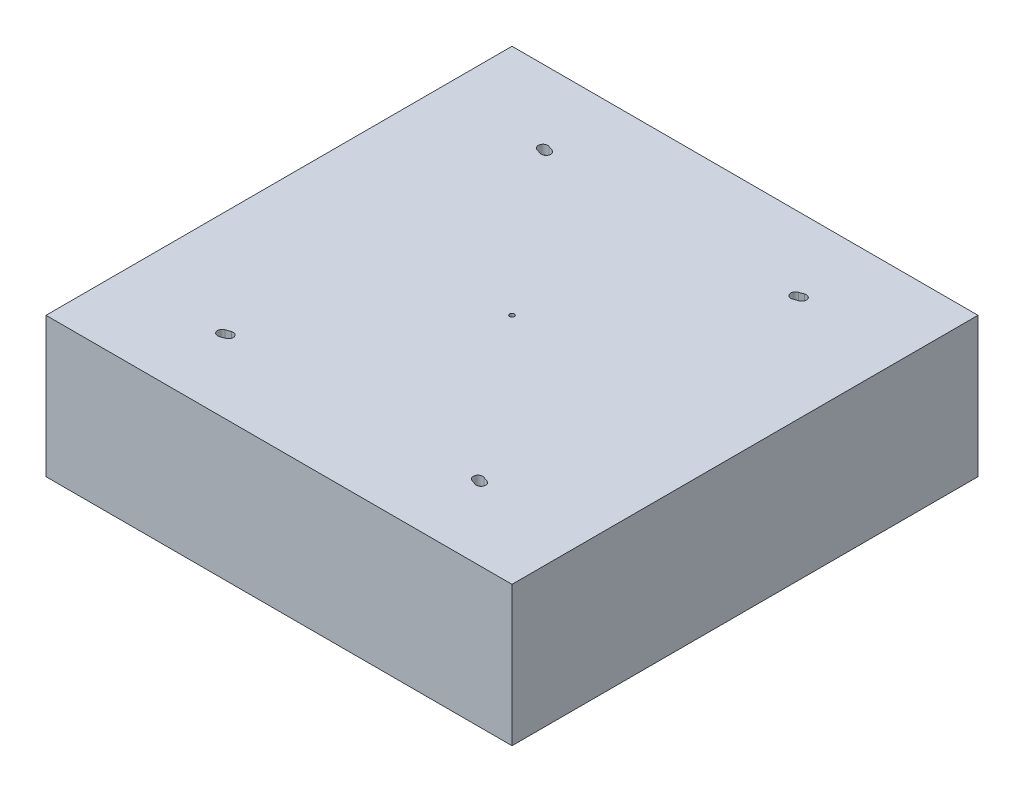
ISO-10303-21;
HEADER;
FILE_DESCRIPTION(('STEP AP214'),'2;1');
FILE_NAME('part.step','',(''),(''),'','','');
FILE_SCHEMA(('AUTOMOTIVE_DESIGN { 1 0 10303 214 1 1 1 1 }'));
ENDSEC;
DATA;
#1=APPLICATION_CONTEXT('core data for automotive mechanical design processes');
#2=APPLICATION_PROTOCOL_DEFINITION('international standard','automotive_design',2000,#1);
#3=PRODUCT_CONTEXT('',#1,'mechanical');
#4=PRODUCT('Part','Part','',(#3));
#5=PRODUCT_RELATED_PRODUCT_CATEGORY('part','',(#4));
#6=PRODUCT_DEFINITION_FORMATION('','',#4);
#7=PRODUCT_DEFINITION_CONTEXT('part definition',#1,'design');
#8=PRODUCT_DEFINITION('design','',#6,#7);
#9=PRODUCT_DEFINITION_SHAPE('','',#8);
#10=(LENGTH_UNIT() NAMED_UNIT(*) SI_UNIT(.MILLI.,.METRE.));
#11=(NAMED_UNIT(*) PLANE_ANGLE_UNIT() SI_UNIT($,.RADIAN.));
#12=(NAMED_UNIT(*) SI_UNIT($,.STERADIAN.) SOLID_ANGLE_UNIT());
#13=UNCERTAINTY_MEASURE_WITH_UNIT(LENGTH_MEASURE(1.E-05),#10,'distance_accuracy_value','');
#14=(GEOMETRIC_REPRESENTATION_CONTEXT(3) GLOBAL_UNCERTAINTY_ASSIGNED_CONTEXT((#13)) GLOBAL_UNIT_ASSIGNED_CONTEXT((#10,
#11,#12)) REPRESENTATION_CONTEXT('',''));
#15=CARTESIAN_POINT('',(0.,0.,0.));
#16=DIRECTION('',(0.,0.,1.));
#17=DIRECTION('',(1.,0.,0.));
#18=AXIS2_PLACEMENT_3D('',#15,#16,#17);
#19=CARTESIAN_POINT('',(0.,15.,0.));
#20=DIRECTION('',(0.,1.,0.));
#21=DIRECTION('',(0.,0.,1.));
#22=AXIS2_PLACEMENT_3D('',#19,#20,#21);
#23=PLANE('',#22);
#24=CARTESIAN_POINT('',(27.7652570431918,15.,-34.4106898083398));
#25=DIRECTION('',(0.,1.,0.));
#26=DIRECTION('',(0.,0.,-1.));
#27=AXIS2_PLACEMENT_3D('',#24,#25,#26);
#28=CIRCLE('',#27,0.999999999999998);
#29=CARTESIAN_POINT('',(28.0908251976489,15.,-33.4651712327405));
#30=VERTEX_POINT('',#29);
#31=CARTESIAN_POINT('',(27.4396888887346,15.,-35.3562083839392));
#32=VERTEX_POINT('',#31);
#33=EDGE_CURVE('E61',#30,#32,#28,.T.);
#34=ORIENTED_EDGE('',*,*,#33,.F.);
#35=DIRECTION('',(0.945518575599316,0.,-0.325568154457158));
#36=VECTOR('',#35,1.);
#37=CARTESIAN_POINT('',(28.0908251976489,15.,-33.4651712327405));
#38=LINE('',#37,#36);
#39=CARTESIAN_POINT('',(27.0908251976489,15.,-33.1208436194509));
#40=VERTEX_POINT('',#39);
#41=EDGE_CURVE('E208',#40,#30,#38,.T.);
#42=ORIENTED_EDGE('',*,*,#41,.F.);
#43=CARTESIAN_POINT('',(26.7652570431918,15.,-34.0663621950502));
#44=DIRECTION('',(0.,1.,0.));
#45=DIRECTION('',(0.,0.,-1.));
#46=AXIS2_PLACEMENT_3D('',#43,#44,#45);
#47=CIRCLE('',#46,0.999999999999998);
#48=CARTESIAN_POINT('',(26.4396888887346,15.,-35.0118807706495));
#49=VERTEX_POINT('',#48);
#50=EDGE_CURVE('E212',#49,#40,#47,.T.);
#51=ORIENTED_EDGE('',*,*,#50,.F.);
#52=DIRECTION('',(-0.945518575599316,0.,0.325568154457158));
#53=VECTOR('',#52,1.);
#54=CARTESIAN_POINT('',(27.4396888887346,15.,-35.3562083839392));
#55=LINE('',#54,#53);
#56=EDGE_CURVE('E221',#32,#49,#55,.T.);
#57=ORIENTED_EDGE('',*,*,#56,.F.);
#58=EDGE_LOOP('',(#34,#42,#51,#57));
#59=FACE_BOUND('',#58,.T.);
#60=CARTESIAN_POINT('',(0.,15.,0.));
#61=DIRECTION('',(0.,1.,0.));
#62=DIRECTION('',(0.,0.,1.));
#63=AXIS2_PLACEMENT_3D('',#60,#61,#62);
#64=CIRCLE('',#63,0.5);
#65=CARTESIAN_POINT('',(0.,15.,0.5));
#66=VERTEX_POINT('',#65);
#67=EDGE_CURVE('E323',#66,#66,#64,.T.);
#68=ORIENTED_EDGE('',*,*,#67,.F.);
#69=EDGE_LOOP('',(#68));
#70=FACE_BOUND('',#69,.T.);
#71=CARTESIAN_POINT('',(-27.7652570431918,15.,34.4106898083398));
#72=DIRECTION('',(0.,1.,0.));
#73=DIRECTION('',(0.,0.,1.));
#74=AXIS2_PLACEMENT_3D('',#71,#72,#73);
#75=CIRCLE('',#74,0.999999999999998);
#76=CARTESIAN_POINT('',(-28.0908251976489,15.,33.4651712327405));
#77=VERTEX_POINT('',#76);
#78=CARTESIAN_POINT('',(-27.4396888887346,15.,35.3562083839392));
#79=VERTEX_POINT('',#78);
#80=EDGE_CURVE('E327',#77,#79,#75,.T.);
#81=ORIENTED_EDGE('',*,*,#80,.F.);
#82=DIRECTION('',(-0.945518575599316,0.,0.325568154457158));
#83=VECTOR('',#82,1.);
#84=CARTESIAN_POINT('',(-28.0908251976489,15.,33.4651712327405));
#85=LINE('',#84,#83);
#86=CARTESIAN_POINT('',(-27.0908251976489,15.,33.1208436194509));
#87=VERTEX_POINT('',#86);
#88=EDGE_CURVE('E341',#87,#77,#85,.T.);
#89=ORIENTED_EDGE('',*,*,#88,.F.);
#90=CARTESIAN_POINT('',(-26.7652570431918,15.,34.0663621950502));
#91=DIRECTION('',(0.,1.,0.));
#92=DIRECTION('',(0.,0.,1.));
#93=AXIS2_PLACEMENT_3D('',#90,#91,#92);
#94=CIRCLE('',#93,0.999999999999998);
#95=CARTESIAN_POINT('',(-26.4396888887346,15.,35.0118807706495));
#96=VERTEX_POINT('',#95);
#97=EDGE_CURVE('E345',#96,#87,#94,.T.);
#98=ORIENTED_EDGE('',*,*,#97,.F.);
#99=DIRECTION('',(0.945518575599316,0.,-0.325568154457158));
#100=VECTOR('',#99,1.);
#101=CARTESIAN_POINT('',(-27.4396888887346,15.,35.3562083839392));
#102=LINE('',#101,#100);
#103=EDGE_CURVE('E350',#79,#96,#102,.T.);
#104=ORIENTED_EDGE('',*,*,#103,.F.);
#105=EDGE_LOOP('',(#81,#89,#98,#104));
#106=FACE_BOUND('',#105,.T.);
#107=DIRECTION('',(0.,0.,1.));
#108=VECTOR('',#107,1.);
#109=CARTESIAN_POINT('',(-50.,15.,-50.));
#110=LINE('',#109,#108);
#111=CARTESIAN_POINT('',(-50.,15.,-50.));
#112=VERTEX_POINT('',#111);
#113=CARTESIAN_POINT('',(-50.,15.,50.));
#114=VERTEX_POINT('',#113);
#115=EDGE_CURVE('E370',#112,#114,#110,.T.);
#116=ORIENTED_EDGE('',*,*,#115,.T.);
#117=DIRECTION('',(1.,0.,0.));
#118=VECTOR('',#117,1.);
#119=CARTESIAN_POINT('',(-50.,15.,50.));
#120=LINE('',#119,#118);
#121=CARTESIAN_POINT('',(50.,15.,50.));
#122=VERTEX_POINT('',#121);
#123=EDGE_CURVE('E374',#114,#122,#120,.T.);
#124=ORIENTED_EDGE('',*,*,#123,.T.);
#125=DIRECTION('',(0.,0.,-1.));
#126=VECTOR('',#125,1.);
#127=CARTESIAN_POINT('',(50.,15.,-50.));
#128=LINE('',#127,#126);
#129=CARTESIAN_POINT('',(50.,15.,-50.));
#130=VERTEX_POINT('',#129);
#131=EDGE_CURVE('E378',#122,#130,#128,.T.);
#132=ORIENTED_EDGE('',*,*,#131,.T.);
#133=DIRECTION('',(-1.,0.,0.));
#134=VECTOR('',#133,1.);
#135=CARTESIAN_POINT('',(-50.,15.,-50.));
#136=LINE('',#135,#134);
#137=EDGE_CURVE('E381',#130,#112,#136,.T.);
#138=ORIENTED_EDGE('',*,*,#137,.T.);
#139=EDGE_LOOP('',(#116,#124,#132,#138));
#140=FACE_BOUND('',#139,.T.);
#141=DIRECTION('',(0.945518575599316,0.,0.325568154457158));
#142=VECTOR('',#141,1.);
#143=CARTESIAN_POINT('',(28.0908251976489,15.,33.4651712327405));
#144=LINE('',#143,#142);
#145=CARTESIAN_POINT('',(27.0908251976489,15.,33.1208436194509));
#146=VERTEX_POINT('',#145);
#147=CARTESIAN_POINT('',(28.0908251976489,15.,33.4651712327405));
#148=VERTEX_POINT('',#147);
#149=EDGE_CURVE('E293',#146,#148,#144,.T.);
#150=ORIENTED_EDGE('',*,*,#149,.T.);
#151=CARTESIAN_POINT('',(27.7652570431918,15.,34.4106898083398));
#152=DIRECTION('',(0.,-1.,0.));
#153=DIRECTION('',(0.,0.,1.));
#154=AXIS2_PLACEMENT_3D('',#151,#152,#153);
#155=CIRCLE('',#154,0.999999999999998);
#156=CARTESIAN_POINT('',(27.4396888887346,15.,35.3562083839392));
#157=VERTEX_POINT('',#156);
#158=EDGE_CURVE('E266',#148,#157,#155,.T.);
#159=ORIENTED_EDGE('',*,*,#158,.T.);
#160=DIRECTION('',(-0.945518575599316,0.,-0.325568154457158));
#161=VECTOR('',#160,1.);
#162=CARTESIAN_POINT('',(27.4396888887346,15.,35.3562083839392));
#163=LINE('',#162,#161);
#164=CARTESIAN_POINT('',(26.4396888887346,15.,35.0118807706495));
#165=VERTEX_POINT('',#164);
#166=EDGE_CURVE('E280',#157,#165,#163,.T.);
#167=ORIENTED_EDGE('',*,*,#166,.T.);
#168=CARTESIAN_POINT('',(26.7652570431918,15.,34.0663621950502));
#169=DIRECTION('',(0.,-1.,0.));
#170=DIRECTION('',(0.,0.,1.));
#171=AXIS2_PLACEMENT_3D('',#168,#169,#170);
#172=CIRCLE('',#171,0.999999999999998);
#173=EDGE_CURVE('E297',#165,#146,#172,.T.);
#174=ORIENTED_EDGE('',*,*,#173,.T.);
#175=EDGE_LOOP('',(#150,#159,#167,#174));
#176=FACE_BOUND('',#175,.T.);
#177=DIRECTION('',(-0.945518575599316,0.,-0.325568154457158));
#178=VECTOR('',#177,1.);
#179=CARTESIAN_POINT('',(-28.0908251976489,15.,-33.4651712327405));
#180=LINE('',#179,#178);
#181=CARTESIAN_POINT('',(-27.0908251976489,15.,-33.1208436194509));
#182=VERTEX_POINT('',#181);
#183=CARTESIAN_POINT('',(-28.0908251976489,15.,-33.4651712327405));
#184=VERTEX_POINT('',#183);
#185=EDGE_CURVE('E252',#182,#184,#180,.T.);
#186=ORIENTED_EDGE('',*,*,#185,.T.);
#187=CARTESIAN_POINT('',(-27.7652570431918,15.,-34.4106898083398));
#188=DIRECTION('',(0.,-1.,0.));
#189=DIRECTION('',(0.,0.,-1.));
#190=AXIS2_PLACEMENT_3D('',#187,#188,#189);
#191=CIRCLE('',#190,0.999999999999998);
#192=CARTESIAN_POINT('',(-27.4396888887346,15.,-35.3562083839392));
#193=VERTEX_POINT('',#192);
#194=EDGE_CURVE('E69',#184,#193,#191,.T.);
#195=ORIENTED_EDGE('',*,*,#194,.T.);
#196=DIRECTION('',(0.945518575599316,0.,0.325568154457158));
#197=VECTOR('',#196,1.);
#198=CARTESIAN_POINT('',(-27.4396888887346,15.,-35.3562083839392));
#199=LINE('',#198,#197);
#200=CARTESIAN_POINT('',(-26.4396888887346,15.,-35.0118807706495));
#201=VERTEX_POINT('',#200);
#202=EDGE_CURVE('E240',#193,#201,#199,.T.);
#203=ORIENTED_EDGE('',*,*,#202,.T.);
#204=CARTESIAN_POINT('',(-26.7652570431918,15.,-34.0663621950502));
#205=DIRECTION('',(0.,-1.,0.));
#206=DIRECTION('',(0.,0.,-1.));
#207=AXIS2_PLACEMENT_3D('',#204,#205,#206);
#208=CIRCLE('',#207,0.999999999999998);
#209=EDGE_CURVE('E256',#201,#182,#208,.T.);
#210=ORIENTED_EDGE('',*,*,#209,.T.);
#211=EDGE_LOOP('',(#186,#195,#203,#210));
#212=FACE_BOUND('',#211,.T.);
#213=ADVANCED_FACE('F45',(#59,#70,#106,#140,#176,#212),#23,.T.);
#214=CARTESIAN_POINT('',(-50.,15.,-50.));
#215=DIRECTION('',(1.,0.,0.));
#216=DIRECTION('',(0.,0.,-1.));
#217=AXIS2_PLACEMENT_3D('',#214,#215,#216);
#218=PLANE('',#217);
#219=DIRECTION('',(0.,0.,1.));
#220=VECTOR('',#219,1.);
#221=CARTESIAN_POINT('',(-50.,-15.,-50.));
#222=LINE('',#221,#220);
#223=CARTESIAN_POINT('',(-50.,-15.,-50.));
#224=VERTEX_POINT('',#223);
#225=CARTESIAN_POINT('',(-50.,-15.,50.));
#226=VERTEX_POINT('',#225);
#227=EDGE_CURVE('E322',#224,#226,#222,.T.);
#228=ORIENTED_EDGE('',*,*,#227,.T.);
#229=DIRECTION('',(0.,-1.,0.));
#230=VECTOR('',#229,1.);
#231=CARTESIAN_POINT('',(-50.,15.,50.));
#232=LINE('',#231,#230);
#233=EDGE_CURVE('E11',#114,#226,#232,.T.);
#234=ORIENTED_EDGE('',*,*,#233,.F.);
#235=ORIENTED_EDGE('',*,*,#115,.F.);
#236=DIRECTION('',(0.,-1.,0.));
#237=VECTOR('',#236,1.);
#238=CARTESIAN_POINT('',(-50.,15.,-50.));
#239=LINE('',#238,#237);
#240=EDGE_CURVE('E384',#112,#224,#239,.T.);
#241=ORIENTED_EDGE('',*,*,#240,.T.);
#242=EDGE_LOOP('',(#228,#234,#235,#241));
#243=FACE_BOUND('',#242,.T.);
#244=ADVANCED_FACE('F47',(#243),#218,.F.);
#245=CARTESIAN_POINT('',(-50.,15.,50.));
#246=DIRECTION('',(0.,0.,-1.));
#247=DIRECTION('',(-1.,0.,0.));
#248=AXIS2_PLACEMENT_3D('',#245,#246,#247);
#249=PLANE('',#248);
#250=DIRECTION('',(1.,0.,0.));
#251=VECTOR('',#250,1.);
#252=CARTESIAN_POINT('',(-50.,-15.,50.));
#253=LINE('',#252,#251);
#254=CARTESIAN_POINT('',(50.,-15.,50.));
#255=VERTEX_POINT('',#254);
#256=EDGE_CURVE('E388',#226,#255,#253,.T.);
#257=ORIENTED_EDGE('',*,*,#256,.T.);
#258=DIRECTION('',(0.,-1.,0.));
#259=VECTOR('',#258,1.);
#260=CARTESIAN_POINT('',(50.,15.,50.));
#261=LINE('',#260,#259);
#262=EDGE_CURVE('E54',#122,#255,#261,.T.);
#263=ORIENTED_EDGE('',*,*,#262,.F.);
#264=ORIENTED_EDGE('',*,*,#123,.F.);
#265=ORIENTED_EDGE('',*,*,#233,.T.);
#266=EDGE_LOOP('',(#257,#263,#264,#265));
#267=FACE_BOUND('',#266,.T.);
#268=ADVANCED_FACE('F424',(#267),#249,.F.);
#269=CARTESIAN_POINT('',(50.,15.,-50.));
#270=DIRECTION('',(-1.,0.,0.));
#271=DIRECTION('',(0.,0.,1.));
#272=AXIS2_PLACEMENT_3D('',#269,#270,#271);
#273=PLANE('',#272);
#274=DIRECTION('',(0.,0.,-1.));
#275=VECTOR('',#274,1.);
#276=CARTESIAN_POINT('',(50.,-15.,-50.));
#277=LINE('',#276,#275);
#278=CARTESIAN_POINT('',(50.,-15.,-50.));
#279=VERTEX_POINT('',#278);
#280=EDGE_CURVE('E391',#255,#279,#277,.T.);
#281=ORIENTED_EDGE('',*,*,#280,.T.);
#282=DIRECTION('',(0.,-1.,0.));
#283=VECTOR('',#282,1.);
#284=CARTESIAN_POINT('',(50.,15.,-50.));
#285=LINE('',#284,#283);
#286=EDGE_CURVE('E399',#130,#279,#285,.T.);
#287=ORIENTED_EDGE('',*,*,#286,.F.);
#288=ORIENTED_EDGE('',*,*,#131,.F.);
#289=ORIENTED_EDGE('',*,*,#262,.T.);
#290=EDGE_LOOP('',(#281,#287,#288,#289));
#291=FACE_BOUND('',#290,.T.);
#292=ADVANCED_FACE('F408',(#291),#273,.F.);
#293=CARTESIAN_POINT('',(-50.,15.,-50.));
#294=DIRECTION('',(0.,0.,1.));
#295=DIRECTION('',(1.,0.,0.));
#296=AXIS2_PLACEMENT_3D('',#293,#294,#295);
#297=PLANE('',#296);
#298=DIRECTION('',(-1.,0.,0.));
#299=VECTOR('',#298,1.);
#300=CARTESIAN_POINT('',(-50.,-15.,-50.));
#301=LINE('',#300,#299);
#302=EDGE_CURVE('E375',#279,#224,#301,.T.);
#303=ORIENTED_EDGE('',*,*,#302,.T.);
#304=ORIENTED_EDGE('',*,*,#240,.F.);
#305=ORIENTED_EDGE('',*,*,#137,.F.);
#306=ORIENTED_EDGE('',*,*,#286,.T.);
#307=EDGE_LOOP('',(#303,#304,#305,#306));
#308=FACE_BOUND('',#307,.T.);
#309=ADVANCED_FACE('F417',(#308),#297,.F.);
#310=CARTESIAN_POINT('',(0.,-15.,0.));
#311=DIRECTION('',(0.,1.,0.));
#312=DIRECTION('',(0.,0.,1.));
#313=AXIS2_PLACEMENT_3D('',#310,#311,#312);
#314=PLANE('',#313);
#315=ORIENTED_EDGE('',*,*,#227,.F.);
#316=ORIENTED_EDGE('',*,*,#302,.F.);
#317=ORIENTED_EDGE('',*,*,#280,.F.);
#318=ORIENTED_EDGE('',*,*,#256,.F.);
#319=EDGE_LOOP('',(#315,#316,#317,#318));
#320=FACE_BOUND('',#319,.T.);
#321=ADVANCED_FACE('F414',(#320),#314,.F.);
#322=CARTESIAN_POINT('',(-27.7652570431918,13.,34.4106898083398));
#323=DIRECTION('',(0.,1.,0.));
#324=DIRECTION('',(0.,0.,1.));
#325=AXIS2_PLACEMENT_3D('',#322,#323,#324);
#326=CYLINDRICAL_SURFACE('',#325,0.999999999999998);
#327=ORIENTED_EDGE('',*,*,#80,.T.);
#328=DIRECTION('',(0.,1.,0.));
#329=VECTOR('',#328,1.);
#330=CARTESIAN_POINT('',(-27.4396888887346,13.,35.3562083839392));
#331=LINE('',#330,#329);
#332=CARTESIAN_POINT('',(-27.4396888887346,13.,35.3562083839392));
#333=VERTEX_POINT('',#332);
#334=EDGE_CURVE('E328',#333,#79,#331,.T.);
#335=ORIENTED_EDGE('',*,*,#334,.F.);
#336=CARTESIAN_POINT('',(-27.7652570431918,13.,34.4106898083398));
#337=DIRECTION('',(0.,1.,0.));
#338=DIRECTION('',(0.,0.,1.));
#339=AXIS2_PLACEMENT_3D('',#336,#337,#338);
#340=CIRCLE('',#339,0.999999999999998);
#341=CARTESIAN_POINT('',(-28.0908251976489,13.,33.4651712327405));
#342=VERTEX_POINT('',#341);
#343=EDGE_CURVE('E346',#342,#333,#340,.T.);
#344=ORIENTED_EDGE('',*,*,#343,.F.);
#345=DIRECTION('',(0.,1.,0.));
#346=VECTOR('',#345,1.);
#347=CARTESIAN_POINT('',(-28.0908251976489,13.,33.4651712327405));
#348=LINE('',#347,#346);
#349=EDGE_CURVE('E308',#342,#77,#348,.T.);
#350=ORIENTED_EDGE('',*,*,#349,.T.);
#351=EDGE_LOOP('',(#327,#335,#344,#350));
#352=FACE_BOUND('',#351,.T.);
#353=ADVANCED_FACE('F445',(#352),#326,.F.);
#354=CARTESIAN_POINT('',(-28.0908251976489,13.,33.4651712327405));
#355=DIRECTION('',(-0.325568154457158,0.,-0.945518575599316));
#356=DIRECTION('',(-0.945518575599316,0.,0.325568154457158));
#357=AXIS2_PLACEMENT_3D('',#354,#355,#356);
#358=PLANE('',#357);
#359=ORIENTED_EDGE('',*,*,#88,.T.);
#360=ORIENTED_EDGE('',*,*,#349,.F.);
#361=DIRECTION('',(-0.945518575599316,0.,0.325568154457158));
#362=VECTOR('',#361,1.);
#363=CARTESIAN_POINT('',(-28.0908251976489,13.,33.4651712327405));
#364=LINE('',#363,#362);
#365=CARTESIAN_POINT('',(-27.0908251976489,13.,33.1208436194509));
#366=VERTEX_POINT('',#365);
#367=EDGE_CURVE('E332',#366,#342,#364,.T.);
#368=ORIENTED_EDGE('',*,*,#367,.F.);
#369=DIRECTION('',(0.,1.,0.));
#370=VECTOR('',#369,1.);
#371=CARTESIAN_POINT('',(-27.0908251976489,13.,33.1208436194509));
#372=LINE('',#371,#370);
#373=EDGE_CURVE('E336',#366,#87,#372,.T.);
#374=ORIENTED_EDGE('',*,*,#373,.T.);
#375=EDGE_LOOP('',(#359,#360,#368,#374));
#376=FACE_BOUND('',#375,.T.);
#377=ADVANCED_FACE('F463',(#376),#358,.F.);
#378=CARTESIAN_POINT('',(-26.7652570431918,13.,34.0663621950502));
#379=DIRECTION('',(0.,1.,0.));
#380=DIRECTION('',(0.,0.,1.));
#381=AXIS2_PLACEMENT_3D('',#378,#379,#380);
#382=CYLINDRICAL_SURFACE('',#381,0.999999999999998);
#383=ORIENTED_EDGE('',*,*,#97,.T.);
#384=ORIENTED_EDGE('',*,*,#373,.F.);
#385=CARTESIAN_POINT('',(-26.7652570431918,13.,34.0663621950502));
#386=DIRECTION('',(0.,1.,0.));
#387=DIRECTION('',(0.,0.,1.));
#388=AXIS2_PLACEMENT_3D('',#385,#386,#387);
#389=CIRCLE('',#388,0.999999999999998);
#390=CARTESIAN_POINT('',(-26.4396888887346,13.,35.0118807706495));
#391=VERTEX_POINT('',#390);
#392=EDGE_CURVE('E359',#391,#366,#389,.T.);
#393=ORIENTED_EDGE('',*,*,#392,.F.);
#394=DIRECTION('',(0.,1.,0.));
#395=VECTOR('',#394,1.);
#396=CARTESIAN_POINT('',(-26.4396888887346,13.,35.0118807706495));
#397=LINE('',#396,#395);
#398=EDGE_CURVE('E333',#391,#96,#397,.T.);
#399=ORIENTED_EDGE('',*,*,#398,.T.);
#400=EDGE_LOOP('',(#383,#384,#393,#399));
#401=FACE_BOUND('',#400,.T.);
#402=ADVANCED_FACE('F472',(#401),#382,.F.);
#403=CARTESIAN_POINT('',(-27.4396888887346,13.,35.3562083839392));
#404=DIRECTION('',(0.325568154457158,0.,0.945518575599316));
#405=DIRECTION('',(0.945518575599316,0.,-0.325568154457158));
#406=AXIS2_PLACEMENT_3D('',#403,#404,#405);
#407=PLANE('',#406);
#408=ORIENTED_EDGE('',*,*,#103,.T.);
#409=ORIENTED_EDGE('',*,*,#398,.F.);
#410=DIRECTION('',(0.945518575599316,0.,-0.325568154457158));
#411=VECTOR('',#410,1.);
#412=CARTESIAN_POINT('',(-27.4396888887346,13.,35.3562083839392));
#413=LINE('',#412,#411);
#414=EDGE_CURVE('E363',#333,#391,#413,.T.);
#415=ORIENTED_EDGE('',*,*,#414,.F.);
#416=ORIENTED_EDGE('',*,*,#334,.T.);
#417=EDGE_LOOP('',(#408,#409,#415,#416));
#418=FACE_BOUND('',#417,.T.);
#419=ADVANCED_FACE('F480',(#418),#407,.F.);
#420=CARTESIAN_POINT('',(-27.7652570431918,13.,34.4106898083398));
#421=DIRECTION('',(0.,1.,0.));
#422=DIRECTION('',(0.,0.,1.));
#423=AXIS2_PLACEMENT_3D('',#420,#421,#422);
#424=PLANE('',#423);
#425=ORIENTED_EDGE('',*,*,#343,.T.);
#426=ORIENTED_EDGE('',*,*,#414,.T.);
#427=ORIENTED_EDGE('',*,*,#392,.T.);
#428=ORIENTED_EDGE('',*,*,#367,.T.);
#429=EDGE_LOOP('',(#425,#426,#427,#428));
#430=FACE_BOUND('',#429,.T.);
#431=ADVANCED_FACE('F441',(#430),#424,.T.);
#432=CARTESIAN_POINT('',(0.,13.,0.));
#433=DIRECTION('',(0.,1.,0.));
#434=DIRECTION('',(0.,0.,1.));
#435=AXIS2_PLACEMENT_3D('',#432,#433,#434);
#436=CYLINDRICAL_SURFACE('',#435,0.5);
#437=CARTESIAN_POINT('',(0.,13.,0.));
#438=DIRECTION('',(0.,1.,0.));
#439=DIRECTION('',(0.,0.,1.));
#440=AXIS2_PLACEMENT_3D('',#437,#438,#439);
#441=CIRCLE('',#440,0.5);
#442=CARTESIAN_POINT('',(0.,13.,0.5));
#443=VERTEX_POINT('',#442);
#444=EDGE_CURVE('E318',#443,#443,#441,.T.);
#445=ORIENTED_EDGE('',*,*,#444,.F.);
#446=EDGE_LOOP('',(#445));
#447=FACE_BOUND('',#446,.T.);
#448=ORIENTED_EDGE('',*,*,#67,.T.);
#449=EDGE_LOOP('',(#448));
#450=FACE_BOUND('',#449,.T.);
#451=ADVANCED_FACE('F497',(#447,#450),#436,.F.);
#452=CARTESIAN_POINT('',(0.,13.,0.));
#453=DIRECTION('',(0.,1.,0.));
#454=DIRECTION('',(0.,0.,1.));
#455=AXIS2_PLACEMENT_3D('',#452,#453,#454);
#456=PLANE('',#455);
#457=ORIENTED_EDGE('',*,*,#444,.T.);
#458=EDGE_LOOP('',(#457));
#459=FACE_BOUND('',#458,.T.);
#460=ADVANCED_FACE('F504',(#459),#456,.T.);
#461=CARTESIAN_POINT('',(27.7652570431918,13.,34.4106898083398));
#462=DIRECTION('',(0.,1.,0.));
#463=DIRECTION('',(0.,0.,1.));
#464=AXIS2_PLACEMENT_3D('',#461,#462,#463);
#465=CYLINDRICAL_SURFACE('',#464,0.999999999999998);
#466=ORIENTED_EDGE('',*,*,#158,.F.);
#467=DIRECTION('',(0.,1.,0.));
#468=VECTOR('',#467,1.);
#469=CARTESIAN_POINT('',(28.0908251976489,13.,33.4651712327405));
#470=LINE('',#469,#468);
#471=CARTESIAN_POINT('',(28.0908251976489,13.,33.4651712327405));
#472=VERTEX_POINT('',#471);
#473=EDGE_CURVE('E289',#472,#148,#470,.T.);
#474=ORIENTED_EDGE('',*,*,#473,.F.);
#475=CARTESIAN_POINT('',(27.7652570431918,13.,34.4106898083398));
#476=DIRECTION('',(0.,-1.,0.));
#477=DIRECTION('',(0.,0.,1.));
#478=AXIS2_PLACEMENT_3D('',#475,#476,#477);
#479=CIRCLE('',#478,0.999999999999998);
#480=CARTESIAN_POINT('',(27.4396888887346,13.,35.3562083839392));
#481=VERTEX_POINT('',#480);
#482=EDGE_CURVE('E275',#472,#481,#479,.T.);
#483=ORIENTED_EDGE('',*,*,#482,.T.);
#484=DIRECTION('',(0.,1.,0.));
#485=VECTOR('',#484,1.);
#486=CARTESIAN_POINT('',(27.4396888887346,13.,35.3562083839392));
#487=LINE('',#486,#485);
#488=EDGE_CURVE('E304',#481,#157,#487,.T.);
#489=ORIENTED_EDGE('',*,*,#488,.T.);
#490=EDGE_LOOP('',(#466,#474,#483,#489));
#491=FACE_BOUND('',#490,.T.);
#492=ADVANCED_FACE('F512',(#491),#465,.F.);
#493=CARTESIAN_POINT('',(27.4396888887346,13.,35.3562083839392));
#494=DIRECTION('',(0.325568154457158,0.,-0.945518575599316));
#495=DIRECTION('',(-0.945518575599316,0.,-0.325568154457158));
#496=AXIS2_PLACEMENT_3D('',#493,#494,#495);
#497=PLANE('',#496);
#498=ORIENTED_EDGE('',*,*,#166,.F.);
#499=ORIENTED_EDGE('',*,*,#488,.F.);
#500=DIRECTION('',(-0.945518575599316,0.,-0.325568154457158));
#501=VECTOR('',#500,1.);
#502=CARTESIAN_POINT('',(27.4396888887346,13.,35.3562083839392));
#503=LINE('',#502,#501);
#504=CARTESIAN_POINT('',(26.4396888887346,13.,35.0118807706495));
#505=VERTEX_POINT('',#504);
#506=EDGE_CURVE('E286',#481,#505,#503,.T.);
#507=ORIENTED_EDGE('',*,*,#506,.T.);
#508=DIRECTION('',(0.,1.,0.));
#509=VECTOR('',#508,1.);
#510=CARTESIAN_POINT('',(26.4396888887346,13.,35.0118807706495));
#511=LINE('',#510,#509);
#512=EDGE_CURVE('E309',#505,#165,#511,.T.);
#513=ORIENTED_EDGE('',*,*,#512,.T.);
#514=EDGE_LOOP('',(#498,#499,#507,#513));
#515=FACE_BOUND('',#514,.T.);
#516=ADVANCED_FACE('F528',(#515),#497,.T.);
#517=CARTESIAN_POINT('',(26.7652570431918,13.,34.0663621950502));
#518=DIRECTION('',(0.,1.,0.));
#519=DIRECTION('',(0.,0.,1.));
#520=AXIS2_PLACEMENT_3D('',#517,#518,#519);
#521=CYLINDRICAL_SURFACE('',#520,0.999999999999998);
#522=ORIENTED_EDGE('',*,*,#173,.F.);
#523=ORIENTED_EDGE('',*,*,#512,.F.);
#524=CARTESIAN_POINT('',(26.7652570431918,13.,34.0663621950502));
#525=DIRECTION('',(0.,-1.,0.));
#526=DIRECTION('',(0.,0.,1.));
#527=AXIS2_PLACEMENT_3D('',#524,#525,#526);
#528=CIRCLE('',#527,0.999999999999998);
#529=CARTESIAN_POINT('',(27.0908251976489,13.,33.1208436194509));
#530=VERTEX_POINT('',#529);
#531=EDGE_CURVE('E283',#505,#530,#528,.T.);
#532=ORIENTED_EDGE('',*,*,#531,.T.);
#533=DIRECTION('',(0.,1.,0.));
#534=VECTOR('',#533,1.);
#535=CARTESIAN_POINT('',(27.0908251976489,13.,33.1208436194509));
#536=LINE('',#535,#534);
#537=EDGE_CURVE('E312',#530,#146,#536,.T.);
#538=ORIENTED_EDGE('',*,*,#537,.T.);
#539=EDGE_LOOP('',(#522,#523,#532,#538));
#540=FACE_BOUND('',#539,.T.);
#541=ADVANCED_FACE('F538',(#540),#521,.F.);
#542=CARTESIAN_POINT('',(28.0908251976489,13.,33.4651712327405));
#543=DIRECTION('',(-0.325568154457158,0.,0.945518575599316));
#544=DIRECTION('',(0.945518575599316,0.,0.325568154457158));
#545=AXIS2_PLACEMENT_3D('',#542,#543,#544);
#546=PLANE('',#545);
#547=ORIENTED_EDGE('',*,*,#149,.F.);
#548=ORIENTED_EDGE('',*,*,#537,.F.);
#549=DIRECTION('',(0.945518575599316,0.,0.325568154457158));
#550=VECTOR('',#549,1.);
#551=CARTESIAN_POINT('',(28.0908251976489,13.,33.4651712327405));
#552=LINE('',#551,#550);
#553=EDGE_CURVE('E279',#530,#472,#552,.T.);
#554=ORIENTED_EDGE('',*,*,#553,.T.);
#555=ORIENTED_EDGE('',*,*,#473,.T.);
#556=EDGE_LOOP('',(#547,#548,#554,#555));
#557=FACE_BOUND('',#556,.T.);
#558=ADVANCED_FACE('F548',(#557),#546,.T.);
#559=CARTESIAN_POINT('',(27.7652570431918,13.,34.4106898083398));
#560=DIRECTION('',(0.,1.,0.));
#561=DIRECTION('',(0.,0.,1.));
#562=AXIS2_PLACEMENT_3D('',#559,#560,#561);
#563=PLANE('',#562);
#564=ORIENTED_EDGE('',*,*,#482,.F.);
#565=ORIENTED_EDGE('',*,*,#553,.F.);
#566=ORIENTED_EDGE('',*,*,#531,.F.);
#567=ORIENTED_EDGE('',*,*,#506,.F.);
#568=EDGE_LOOP('',(#564,#565,#566,#567));
#569=FACE_BOUND('',#568,.T.);
#570=ADVANCED_FACE('F558',(#569),#563,.T.);
#571=CARTESIAN_POINT('',(-27.7652570431918,13.,-34.4106898083398));
#572=DIRECTION('',(0.,1.,0.));
#573=DIRECTION('',(0.,0.,1.));
#574=AXIS2_PLACEMENT_3D('',#571,#572,#573);
#575=CYLINDRICAL_SURFACE('',#574,0.999999999999998);
#576=ORIENTED_EDGE('',*,*,#194,.F.);
#577=DIRECTION('',(0.,1.,0.));
#578=VECTOR('',#577,1.);
#579=CARTESIAN_POINT('',(-28.0908251976489,13.,-33.4651712327405));
#580=LINE('',#579,#578);
#581=CARTESIAN_POINT('',(-28.0908251976489,13.,-33.4651712327405));
#582=VERTEX_POINT('',#581);
#583=EDGE_CURVE('E249',#582,#184,#580,.T.);
#584=ORIENTED_EDGE('',*,*,#583,.F.);
#585=CARTESIAN_POINT('',(-27.7652570431918,13.,-34.4106898083398));
#586=DIRECTION('',(0.,-1.,0.));
#587=DIRECTION('',(0.,0.,-1.));
#588=AXIS2_PLACEMENT_3D('',#585,#586,#587);
#589=CIRCLE('',#588,0.999999999999998);
#590=CARTESIAN_POINT('',(-27.4396888887346,13.,-35.3562083839392));
#591=VERTEX_POINT('',#590);
#592=EDGE_CURVE('E235',#582,#591,#589,.T.);
#593=ORIENTED_EDGE('',*,*,#592,.T.);
#594=DIRECTION('',(0.,1.,0.));
#595=VECTOR('',#594,1.);
#596=CARTESIAN_POINT('',(-27.4396888887346,13.,-35.3562083839392));
#597=LINE('',#596,#595);
#598=EDGE_CURVE('E263',#591,#193,#597,.T.);
#599=ORIENTED_EDGE('',*,*,#598,.T.);
#600=EDGE_LOOP('',(#576,#584,#593,#599));
#601=FACE_BOUND('',#600,.T.);
#602=ADVANCED_FACE('F568',(#601),#575,.F.);
#603=CARTESIAN_POINT('',(-27.4396888887346,13.,-35.3562083839392));
#604=DIRECTION('',(-0.325568154457158,0.,0.945518575599316));
#605=DIRECTION('',(0.945518575599316,0.,0.325568154457158));
#606=AXIS2_PLACEMENT_3D('',#603,#604,#605);
#607=PLANE('',#606);
#608=ORIENTED_EDGE('',*,*,#202,.F.);
#609=ORIENTED_EDGE('',*,*,#598,.F.);
#610=DIRECTION('',(0.945518575599316,0.,0.325568154457158));
#611=VECTOR('',#610,1.);
#612=CARTESIAN_POINT('',(-27.4396888887346,13.,-35.3562083839392));
#613=LINE('',#612,#611);
#614=CARTESIAN_POINT('',(-26.4396888887346,13.,-35.0118807706495));
#615=VERTEX_POINT('',#614);
#616=EDGE_CURVE('E246',#591,#615,#613,.T.);
#617=ORIENTED_EDGE('',*,*,#616,.T.);
#618=DIRECTION('',(0.,1.,0.));
#619=VECTOR('',#618,1.);
#620=CARTESIAN_POINT('',(-26.4396888887346,13.,-35.0118807706495));
#621=LINE('',#620,#619);
#622=EDGE_CURVE('E267',#615,#201,#621,.T.);
#623=ORIENTED_EDGE('',*,*,#622,.T.);
#624=EDGE_LOOP('',(#608,#609,#617,#623));
#625=FACE_BOUND('',#624,.T.);
#626=ADVANCED_FACE('F578',(#625),#607,.T.);
#627=CARTESIAN_POINT('',(-26.7652570431918,13.,-34.0663621950502));
#628=DIRECTION('',(0.,1.,0.));
#629=DIRECTION('',(0.,0.,1.));
#630=AXIS2_PLACEMENT_3D('',#627,#628,#629);
#631=CYLINDRICAL_SURFACE('',#630,0.999999999999998);
#632=ORIENTED_EDGE('',*,*,#209,.F.);
#633=ORIENTED_EDGE('',*,*,#622,.F.);
#634=CARTESIAN_POINT('',(-26.7652570431918,13.,-34.0663621950502));
#635=DIRECTION('',(0.,-1.,0.));
#636=DIRECTION('',(0.,0.,-1.));
#637=AXIS2_PLACEMENT_3D('',#634,#635,#636);
#638=CIRCLE('',#637,0.999999999999998);
#639=CARTESIAN_POINT('',(-27.0908251976489,13.,-33.1208436194509));
#640=VERTEX_POINT('',#639);
#641=EDGE_CURVE('E243',#615,#640,#638,.T.);
#642=ORIENTED_EDGE('',*,*,#641,.T.);
#643=DIRECTION('',(0.,1.,0.));
#644=VECTOR('',#643,1.);
#645=CARTESIAN_POINT('',(-27.0908251976489,13.,-33.1208436194509));
#646=LINE('',#645,#644);
#647=EDGE_CURVE('E270',#640,#182,#646,.T.);
#648=ORIENTED_EDGE('',*,*,#647,.T.);
#649=EDGE_LOOP('',(#632,#633,#642,#648));
#650=FACE_BOUND('',#649,.T.);
#651=ADVANCED_FACE('F587',(#650),#631,.F.);
#652=CARTESIAN_POINT('',(-28.0908251976489,13.,-33.4651712327405));
#653=DIRECTION('',(0.325568154457158,0.,-0.945518575599316));
#654=DIRECTION('',(-0.945518575599316,0.,-0.325568154457158));
#655=AXIS2_PLACEMENT_3D('',#652,#653,#654);
#656=PLANE('',#655);
#657=ORIENTED_EDGE('',*,*,#185,.F.);
#658=ORIENTED_EDGE('',*,*,#647,.F.);
#659=DIRECTION('',(-0.945518575599316,0.,-0.325568154457158));
#660=VECTOR('',#659,1.);
#661=CARTESIAN_POINT('',(-28.0908251976489,13.,-33.4651712327405));
#662=LINE('',#661,#660);
#663=EDGE_CURVE('E239',#640,#582,#662,.T.);
#664=ORIENTED_EDGE('',*,*,#663,.T.);
#665=ORIENTED_EDGE('',*,*,#583,.T.);
#666=EDGE_LOOP('',(#657,#658,#664,#665));
#667=FACE_BOUND('',#666,.T.);
#668=ADVANCED_FACE('F597',(#667),#656,.T.);
#669=CARTESIAN_POINT('',(-27.7652570431918,13.,-34.4106898083398));
#670=DIRECTION('',(0.,1.,0.));
#671=DIRECTION('',(0.,0.,-1.));
#672=AXIS2_PLACEMENT_3D('',#669,#670,#671);
#673=PLANE('',#672);
#674=ORIENTED_EDGE('',*,*,#592,.F.);
#675=ORIENTED_EDGE('',*,*,#663,.F.);
#676=ORIENTED_EDGE('',*,*,#641,.F.);
#677=ORIENTED_EDGE('',*,*,#616,.F.);
#678=EDGE_LOOP('',(#674,#675,#676,#677));
#679=FACE_BOUND('',#678,.T.);
#680=ADVANCED_FACE('F607',(#679),#673,.T.);
#681=CARTESIAN_POINT('',(27.7652570431918,13.,-34.4106898083398));
#682=DIRECTION('',(0.,1.,0.));
#683=DIRECTION('',(0.,0.,1.));
#684=AXIS2_PLACEMENT_3D('',#681,#682,#683);
#685=CYLINDRICAL_SURFACE('',#684,0.999999999999998);
#686=ORIENTED_EDGE('',*,*,#33,.T.);
#687=DIRECTION('',(0.,1.,0.));
#688=VECTOR('',#687,1.);
#689=CARTESIAN_POINT('',(27.4396888887346,13.,-35.3562083839392));
#690=LINE('',#689,#688);
#691=CARTESIAN_POINT('',(27.4396888887346,13.,-35.3562083839392));
#692=VERTEX_POINT('',#691);
#693=EDGE_CURVE('E183',#692,#32,#690,.T.);
#694=ORIENTED_EDGE('',*,*,#693,.F.);
#695=CARTESIAN_POINT('',(27.7652570431918,13.,-34.4106898083398));
#696=DIRECTION('',(0.,1.,0.));
#697=DIRECTION('',(0.,0.,-1.));
#698=AXIS2_PLACEMENT_3D('',#695,#696,#697);
#699=CIRCLE('',#698,0.999999999999998);
#700=CARTESIAN_POINT('',(28.0908251976489,13.,-33.4651712327405));
#701=VERTEX_POINT('',#700);
#702=EDGE_CURVE('E187',#701,#692,#699,.T.);
#703=ORIENTED_EDGE('',*,*,#702,.F.);
#704=DIRECTION('',(0.,1.,0.));
#705=VECTOR('',#704,1.);
#706=CARTESIAN_POINT('',(28.0908251976489,13.,-33.4651712327405));
#707=LINE('',#706,#705);
#708=EDGE_CURVE('E227',#701,#30,#707,.T.);
#709=ORIENTED_EDGE('',*,*,#708,.T.);
#710=EDGE_LOOP('',(#686,#694,#703,#709));
#711=FACE_BOUND('',#710,.T.);
#712=ADVANCED_FACE('F185',(#711),#685,.F.);
#713=CARTESIAN_POINT('',(28.0908251976489,13.,-33.4651712327405));
#714=DIRECTION('',(0.325568154457158,0.,0.945518575599316));
#715=DIRECTION('',(0.945518575599316,0.,-0.325568154457158));
#716=AXIS2_PLACEMENT_3D('',#713,#714,#715);
#717=PLANE('',#716);
#718=ORIENTED_EDGE('',*,*,#41,.T.);
#719=ORIENTED_EDGE('',*,*,#708,.F.);
#720=DIRECTION('',(0.945518575599316,0.,-0.325568154457158));
#721=VECTOR('',#720,1.);
#722=CARTESIAN_POINT('',(28.0908251976489,13.,-33.4651712327405));
#723=LINE('',#722,#721);
#724=CARTESIAN_POINT('',(27.0908251976489,13.,-33.1208436194509));
#725=VERTEX_POINT('',#724);
#726=EDGE_CURVE('E194',#725,#701,#723,.T.);
#727=ORIENTED_EDGE('',*,*,#726,.F.);
#728=DIRECTION('',(0.,1.,0.));
#729=VECTOR('',#728,1.);
#730=CARTESIAN_POINT('',(27.0908251976489,13.,-33.1208436194509));
#731=LINE('',#730,#729);
#732=EDGE_CURVE('E230',#725,#40,#731,.T.);
#733=ORIENTED_EDGE('',*,*,#732,.T.);
#734=EDGE_LOOP('',(#718,#719,#727,#733));
#735=FACE_BOUND('',#734,.T.);
#736=ADVANCED_FACE('F626',(#735),#717,.F.);
#737=CARTESIAN_POINT('',(26.7652570431918,13.,-34.0663621950502));
#738=DIRECTION('',(0.,1.,0.));
#739=DIRECTION('',(0.,0.,1.));
#740=AXIS2_PLACEMENT_3D('',#737,#738,#739);
#741=CYLINDRICAL_SURFACE('',#740,0.999999999999998);
#742=ORIENTED_EDGE('',*,*,#50,.T.);
#743=ORIENTED_EDGE('',*,*,#732,.F.);
#744=CARTESIAN_POINT('',(26.7652570431918,13.,-34.0663621950502));
#745=DIRECTION('',(0.,1.,0.));
#746=DIRECTION('',(0.,0.,-1.));
#747=AXIS2_PLACEMENT_3D('',#744,#745,#746);
#748=CIRCLE('',#747,0.999999999999998);
#749=CARTESIAN_POINT('',(26.4396888887346,13.,-35.0118807706495));
#750=VERTEX_POINT('',#749);
#751=EDGE_CURVE('E203',#750,#725,#748,.T.);
#752=ORIENTED_EDGE('',*,*,#751,.F.);
#753=DIRECTION('',(0.,1.,0.));
#754=VECTOR('',#753,1.);
#755=CARTESIAN_POINT('',(26.4396888887346,13.,-35.0118807706495));
#756=LINE('',#755,#754);
#757=EDGE_CURVE('E193',#750,#49,#756,.T.);
#758=ORIENTED_EDGE('',*,*,#757,.T.);
#759=EDGE_LOOP('',(#742,#743,#752,#758));
#760=FACE_BOUND('',#759,.T.);
#761=ADVANCED_FACE('F635',(#760),#741,.F.);
#762=CARTESIAN_POINT('',(27.4396888887346,13.,-35.3562083839392));
#763=DIRECTION('',(-0.325568154457158,0.,-0.945518575599316));
#764=DIRECTION('',(-0.945518575599316,0.,0.325568154457158));
#765=AXIS2_PLACEMENT_3D('',#762,#763,#764);
#766=PLANE('',#765);
#767=ORIENTED_EDGE('',*,*,#56,.T.);
#768=ORIENTED_EDGE('',*,*,#757,.F.);
#769=DIRECTION('',(-0.945518575599316,0.,0.325568154457158));
#770=VECTOR('',#769,1.);
#771=CARTESIAN_POINT('',(27.4396888887346,13.,-35.3562083839392));
#772=LINE('',#771,#770);
#773=EDGE_CURVE('E197',#692,#750,#772,.T.);
#774=ORIENTED_EDGE('',*,*,#773,.F.);
#775=ORIENTED_EDGE('',*,*,#693,.T.);
#776=EDGE_LOOP('',(#767,#768,#774,#775));
#777=FACE_BOUND('',#776,.T.);
#778=ADVANCED_FACE('F198',(#777),#766,.F.);
#779=CARTESIAN_POINT('',(27.7652570431918,13.,-34.4106898083398));
#780=DIRECTION('',(0.,1.,0.));
#781=DIRECTION('',(0.,0.,-1.));
#782=AXIS2_PLACEMENT_3D('',#779,#780,#781);
#783=PLANE('',#782);
#784=ORIENTED_EDGE('',*,*,#702,.T.);
#785=ORIENTED_EDGE('',*,*,#773,.T.);
#786=ORIENTED_EDGE('',*,*,#751,.T.);
#787=ORIENTED_EDGE('',*,*,#726,.T.);
#788=EDGE_LOOP('',(#784,#785,#786,#787));
#789=FACE_BOUND('',#788,.T.);
#790=ADVANCED_FACE('F205',(#789),#783,.T.);
#791=CLOSED_SHELL('',(#213,#244,#268,#292,#309,#321,#353,#377,#402,#419,#431,#451,#460,#492,
#516,#541,#558,#570,#602,#626,#651,#668,#680,#712,#736,#761,#778,#790));
#792=MANIFOLD_SOLID_BREP('B2',#791);
#793=ADVANCED_BREP_SHAPE_REPRESENTATION('',(#18,#792),#14);
#794=SHAPE_DEFINITION_REPRESENTATION(#9,#793);
ENDSEC;
END-ISO-10303-21;
